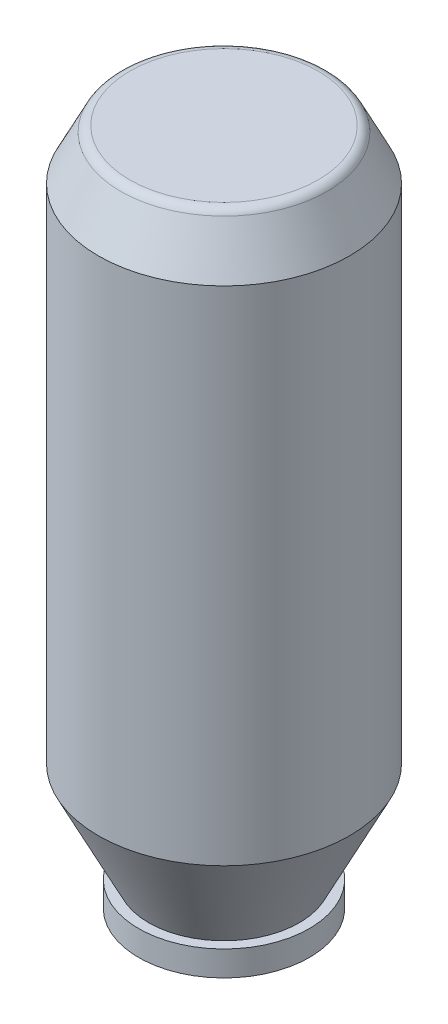
ISO-10303-21;
HEADER;
FILE_DESCRIPTION(('STEP AP214'),'2;1');
FILE_NAME('part.step','',(''),(''),'','','');
FILE_SCHEMA(('AUTOMOTIVE_DESIGN { 1 0 10303 214 1 1 1 1 }'));
ENDSEC;
DATA;
#1=APPLICATION_CONTEXT('core data for automotive mechanical design processes');
#2=APPLICATION_PROTOCOL_DEFINITION('international standard','automotive_design',2000,#1);
#3=PRODUCT_CONTEXT('',#1,'mechanical');
#4=PRODUCT('Part','Part','',(#3));
#5=PRODUCT_RELATED_PRODUCT_CATEGORY('part','',(#4));
#6=PRODUCT_DEFINITION_FORMATION('','',#4);
#7=PRODUCT_DEFINITION_CONTEXT('part definition',#1,'design');
#8=PRODUCT_DEFINITION('design','',#6,#7);
#9=PRODUCT_DEFINITION_SHAPE('','',#8);
#10=(LENGTH_UNIT() NAMED_UNIT(*) SI_UNIT(.MILLI.,.METRE.));
#11=(NAMED_UNIT(*) PLANE_ANGLE_UNIT() SI_UNIT($,.RADIAN.));
#12=(NAMED_UNIT(*) SI_UNIT($,.STERADIAN.) SOLID_ANGLE_UNIT());
#13=UNCERTAINTY_MEASURE_WITH_UNIT(LENGTH_MEASURE(1.E-05),#10,'distance_accuracy_value','');
#14=(GEOMETRIC_REPRESENTATION_CONTEXT(3) GLOBAL_UNCERTAINTY_ASSIGNED_CONTEXT((#13)) GLOBAL_UNIT_ASSIGNED_CONTEXT((#10,
#11,#12)) REPRESENTATION_CONTEXT('',''));
#15=CARTESIAN_POINT('',(0.,0.,0.));
#16=DIRECTION('',(0.,0.,1.));
#17=DIRECTION('',(1.,0.,0.));
#18=AXIS2_PLACEMENT_3D('',#15,#16,#17);
#19=CARTESIAN_POINT('',(0.,10.,0.));
#20=DIRECTION('',(0.,1.,0.));
#21=DIRECTION('',(0.,0.,1.));
#22=AXIS2_PLACEMENT_3D('',#19,#20,#21);
#23=PLANE('',#22);
#24=CARTESIAN_POINT('',(0.,10.,0.));
#25=DIRECTION('',(0.,1.,0.));
#26=DIRECTION('',(0.,0.,1.));
#27=AXIS2_PLACEMENT_3D('',#24,#25,#26);
#28=CIRCLE('',#27,18.7639320225002);
#29=CARTESIAN_POINT('',(0.,10.,18.7639320225002));
#30=VERTEX_POINT('',#29);
#31=EDGE_CURVE('E10',#30,#30,#28,.T.);
#32=ORIENTED_EDGE('',*,*,#31,.T.);
#33=EDGE_LOOP('',(#32));
#34=FACE_BOUND('',#33,.T.);
#35=ADVANCED_FACE('F37',(#34),#23,.T.);
#36=CARTESIAN_POINT('',(0.,0.,0.));
#37=DIRECTION('',(0.,-1.,0.));
#38=DIRECTION('',(0.,0.,-1.));
#39=AXIS2_PLACEMENT_3D('',#36,#37,#38);
#40=CONICAL_SURFACE('',#39,25.,0.463647609000806);
#41=CARTESIAN_POINT('',(0.,8.89442719099991,0.));
#42=DIRECTION('',(0.,1.,0.));
#43=DIRECTION('',(0.,0.,1.));
#44=AXIS2_PLACEMENT_3D('',#41,#42,#43);
#45=CIRCLE('',#44,20.5527864045);
#46=CARTESIAN_POINT('',(0.,8.89442719099991,20.5527864045));
#47=VERTEX_POINT('',#46);
#48=EDGE_CURVE('E45',#47,#47,#45,.F.);
#49=ORIENTED_EDGE('',*,*,#48,.T.);
#50=EDGE_LOOP('',(#49));
#51=FACE_BOUND('',#50,.T.);
#52=CARTESIAN_POINT('',(0.,0.,0.));
#53=DIRECTION('',(0.,-1.,0.));
#54=DIRECTION('',(0.,0.,-1.));
#55=AXIS2_PLACEMENT_3D('',#52,#53,#54);
#56=CIRCLE('',#55,25.);
#57=CARTESIAN_POINT('',(0.,0.,-25.));
#58=VERTEX_POINT('',#57);
#59=EDGE_CURVE('E50',#58,#58,#56,.T.);
#60=ORIENTED_EDGE('',*,*,#59,.F.);
#61=EDGE_LOOP('',(#60));
#62=FACE_BOUND('',#61,.T.);
#63=ADVANCED_FACE('F95',(#51,#62),#40,.T.);
#64=CARTESIAN_POINT('',(0.,-100.,0.));
#65=DIRECTION('',(0.,1.,0.));
#66=DIRECTION('',(0.,0.,1.));
#67=AXIS2_PLACEMENT_3D('',#64,#65,#66);
#68=CYLINDRICAL_SURFACE('',#67,25.);
#69=CARTESIAN_POINT('',(0.,-100.,0.));
#70=DIRECTION('',(0.,-1.,0.));
#71=DIRECTION('',(0.,0.,-1.));
#72=AXIS2_PLACEMENT_3D('',#69,#70,#71);
#73=CIRCLE('',#72,25.);
#74=CARTESIAN_POINT('',(0.,-100.,-25.));
#75=VERTEX_POINT('',#74);
#76=EDGE_CURVE('E55',#75,#75,#73,.T.);
#77=ORIENTED_EDGE('',*,*,#76,.F.);
#78=EDGE_LOOP('',(#77));
#79=FACE_BOUND('',#78,.T.);
#80=ORIENTED_EDGE('',*,*,#59,.T.);
#81=EDGE_LOOP('',(#80));
#82=FACE_BOUND('',#81,.T.);
#83=ADVANCED_FACE('F99',(#79,#82),#68,.T.);
#84=CARTESIAN_POINT('',(0.,-100.,0.));
#85=DIRECTION('',(0.,1.,0.));
#86=DIRECTION('',(0.,0.,1.));
#87=AXIS2_PLACEMENT_3D('',#84,#85,#86);
#88=CONICAL_SURFACE('',#87,25.,0.463647609000806);
#89=CARTESIAN_POINT('',(0.,-120.,0.));
#90=DIRECTION('',(0.,1.,0.));
#91=DIRECTION('',(0.,0.,1.));
#92=AXIS2_PLACEMENT_3D('',#89,#90,#91);
#93=CIRCLE('',#92,15.);
#94=CARTESIAN_POINT('',(0.,-120.,15.));
#95=VERTEX_POINT('',#94);
#96=EDGE_CURVE('E61',#95,#95,#93,.T.);
#97=ORIENTED_EDGE('',*,*,#96,.T.);
#98=EDGE_LOOP('',(#97));
#99=FACE_BOUND('',#98,.T.);
#100=ORIENTED_EDGE('',*,*,#76,.T.);
#101=EDGE_LOOP('',(#100));
#102=FACE_BOUND('',#101,.T.);
#103=ADVANCED_FACE('F79',(#99,#102),#88,.T.);
#104=CARTESIAN_POINT('',(0.,-125.,0.));
#105=DIRECTION('',(0.,1.,0.));
#106=DIRECTION('',(0.,0.,1.));
#107=AXIS2_PLACEMENT_3D('',#104,#105,#106);
#108=CYLINDRICAL_SURFACE('',#107,17.);
#109=CARTESIAN_POINT('',(0.,-125.,0.));
#110=DIRECTION('',(0.,-1.,0.));
#111=DIRECTION('',(0.,0.,-1.));
#112=AXIS2_PLACEMENT_3D('',#109,#110,#111);
#113=CIRCLE('',#112,17.);
#114=CARTESIAN_POINT('',(0.,-125.,-17.));
#115=VERTEX_POINT('',#114);
#116=EDGE_CURVE('E65',#115,#115,#113,.T.);
#117=ORIENTED_EDGE('',*,*,#116,.F.);
#118=EDGE_LOOP('',(#117));
#119=FACE_BOUND('',#118,.T.);
#120=CARTESIAN_POINT('',(0.,-120.,0.));
#121=DIRECTION('',(0.,-1.,0.));
#122=DIRECTION('',(0.,0.,-1.));
#123=AXIS2_PLACEMENT_3D('',#120,#121,#122);
#124=CIRCLE('',#123,17.);
#125=CARTESIAN_POINT('',(0.,-120.,-17.));
#126=VERTEX_POINT('',#125);
#127=EDGE_CURVE('E66',#126,#126,#124,.T.);
#128=ORIENTED_EDGE('',*,*,#127,.T.);
#129=EDGE_LOOP('',(#128));
#130=FACE_BOUND('',#129,.T.);
#131=ADVANCED_FACE('F76',(#119,#130),#108,.T.);
#132=CARTESIAN_POINT('',(0.,-125.,0.));
#133=DIRECTION('',(0.,-1.,0.));
#134=DIRECTION('',(0.,0.,-1.));
#135=AXIS2_PLACEMENT_3D('',#132,#133,#134);
#136=PLANE('',#135);
#137=ORIENTED_EDGE('',*,*,#116,.T.);
#138=EDGE_LOOP('',(#137));
#139=FACE_BOUND('',#138,.T.);
#140=ADVANCED_FACE('F74',(#139),#136,.T.);
#141=CARTESIAN_POINT('',(0.,-120.,0.));
#142=DIRECTION('',(0.,-1.,0.));
#143=DIRECTION('',(0.,0.,-1.));
#144=AXIS2_PLACEMENT_3D('',#141,#142,#143);
#145=PLANE('',#144);
#146=ORIENTED_EDGE('',*,*,#96,.F.);
#147=EDGE_LOOP('',(#146));
#148=FACE_BOUND('',#147,.T.);
#149=ORIENTED_EDGE('',*,*,#127,.F.);
#150=EDGE_LOOP('',(#149));
#151=FACE_BOUND('',#150,.T.);
#152=ADVANCED_FACE('F83',(#148,#151),#145,.F.);
#153=CARTESIAN_POINT('',(0.,8.,0.));
#154=DIRECTION('',(0.,1.,0.));
#155=DIRECTION('',(0.,0.,1.));
#156=AXIS2_PLACEMENT_3D('',#153,#154,#155);
#157=TOROIDAL_SURFACE('',#156,18.7639320225002,2.);
#158=ORIENTED_EDGE('',*,*,#31,.F.);
#159=EDGE_LOOP('',(#158));
#160=FACE_BOUND('',#159,.T.);
#161=ORIENTED_EDGE('',*,*,#48,.F.);
#162=EDGE_LOOP('',(#161));
#163=FACE_BOUND('',#162,.T.);
#164=ADVANCED_FACE('F39',(#160,#163),#157,.T.);
#165=CLOSED_SHELL('',(#35,#63,#83,#103,#131,#140,#152,#164));
#166=MANIFOLD_SOLID_BREP('B2',#165);
#167=ADVANCED_BREP_SHAPE_REPRESENTATION('',(#18,#166),#14);
#168=SHAPE_DEFINITION_REPRESENTATION(#9,#167);
ENDSEC;
END-ISO-10303-21;
